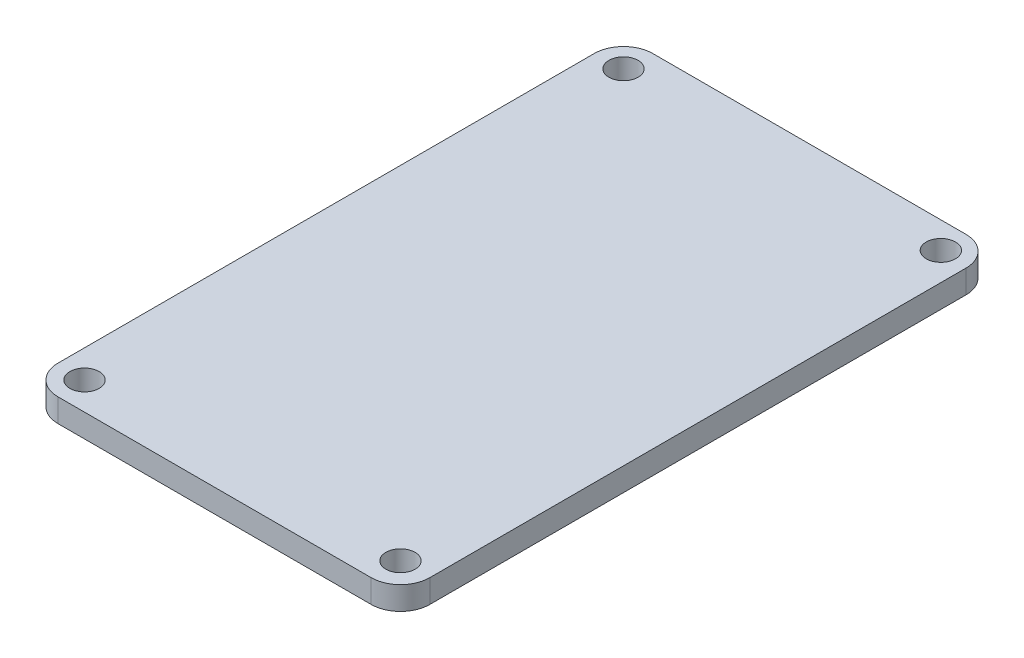
ISO-10303-21;
HEADER;
FILE_DESCRIPTION(('STEP AP214'),'2;1');
FILE_NAME('part.step','',(''),(''),'','','');
FILE_SCHEMA(('AUTOMOTIVE_DESIGN { 1 0 10303 214 1 1 1 1 }'));
ENDSEC;
DATA;
#1=APPLICATION_CONTEXT('core data for automotive mechanical design processes');
#2=APPLICATION_PROTOCOL_DEFINITION('international standard','automotive_design',2000,#1);
#3=PRODUCT_CONTEXT('',#1,'mechanical');
#4=PRODUCT('Part','Part','',(#3));
#5=PRODUCT_RELATED_PRODUCT_CATEGORY('part','',(#4));
#6=PRODUCT_DEFINITION_FORMATION('','',#4);
#7=PRODUCT_DEFINITION_CONTEXT('part definition',#1,'design');
#8=PRODUCT_DEFINITION('design','',#6,#7);
#9=PRODUCT_DEFINITION_SHAPE('','',#8);
#10=(LENGTH_UNIT() NAMED_UNIT(*) SI_UNIT(.MILLI.,.METRE.));
#11=(NAMED_UNIT(*) PLANE_ANGLE_UNIT() SI_UNIT($,.RADIAN.));
#12=(NAMED_UNIT(*) SI_UNIT($,.STERADIAN.) SOLID_ANGLE_UNIT());
#13=UNCERTAINTY_MEASURE_WITH_UNIT(LENGTH_MEASURE(1.E-05),#10,'distance_accuracy_value','');
#14=(GEOMETRIC_REPRESENTATION_CONTEXT(3) GLOBAL_UNCERTAINTY_ASSIGNED_CONTEXT((#13)) GLOBAL_UNIT_ASSIGNED_CONTEXT((#10,
#11,#12)) REPRESENTATION_CONTEXT('',''));
#15=CARTESIAN_POINT('',(0.,0.,0.));
#16=DIRECTION('',(0.,0.,1.));
#17=DIRECTION('',(1.,0.,0.));
#18=AXIS2_PLACEMENT_3D('',#15,#16,#17);
#19=CARTESIAN_POINT('',(-10.7,1.5875,18.32));
#20=DIRECTION('',(0.,-1.,0.));
#21=DIRECTION('',(0.,0.,-1.));
#22=AXIS2_PLACEMENT_3D('',#19,#20,#21);
#23=CYLINDRICAL_SURFACE('',#22,2.);
#24=CARTESIAN_POINT('',(-10.7,0.,18.32));
#25=DIRECTION('',(0.,1.,0.));
#26=DIRECTION('',(0.,0.,1.));
#27=AXIS2_PLACEMENT_3D('',#24,#25,#26);
#28=CIRCLE('',#27,2.);
#29=CARTESIAN_POINT('',(-12.7,0.,18.32));
#30=VERTEX_POINT('',#29);
#31=CARTESIAN_POINT('',(-10.7,0.,20.32));
#32=VERTEX_POINT('',#31);
#33=EDGE_CURVE('E131',#30,#32,#28,.T.);
#34=ORIENTED_EDGE('',*,*,#33,.T.);
#35=DIRECTION('',(0.,-1.,0.));
#36=VECTOR('',#35,1.);
#37=CARTESIAN_POINT('',(-10.7,1.5875,20.32));
#38=LINE('',#37,#36);
#39=CARTESIAN_POINT('',(-10.7,1.5875,20.32));
#40=VERTEX_POINT('',#39);
#41=EDGE_CURVE('E11',#40,#32,#38,.T.);
#42=ORIENTED_EDGE('',*,*,#41,.F.);
#43=CARTESIAN_POINT('',(-10.7,1.5875,18.32));
#44=DIRECTION('',(0.,1.,0.));
#45=DIRECTION('',(0.,0.,1.));
#46=AXIS2_PLACEMENT_3D('',#43,#44,#45);
#47=CIRCLE('',#46,2.);
#48=CARTESIAN_POINT('',(-12.7,1.5875,18.32));
#49=VERTEX_POINT('',#48);
#50=EDGE_CURVE('E146',#49,#40,#47,.T.);
#51=ORIENTED_EDGE('',*,*,#50,.F.);
#52=DIRECTION('',(0.,-1.,0.));
#53=VECTOR('',#52,1.);
#54=CARTESIAN_POINT('',(-12.7,1.5875,18.32));
#55=LINE('',#54,#53);
#56=EDGE_CURVE('E127',#49,#30,#55,.T.);
#57=ORIENTED_EDGE('',*,*,#56,.T.);
#58=EDGE_LOOP('',(#34,#42,#51,#57));
#59=FACE_BOUND('',#58,.T.);
#60=ADVANCED_FACE('F33',(#59),#23,.T.);
#61=CARTESIAN_POINT('',(-10.7,1.5875,20.32));
#62=DIRECTION('',(0.,0.,-1.));
#63=DIRECTION('',(-1.,0.,0.));
#64=AXIS2_PLACEMENT_3D('',#61,#62,#63);
#65=PLANE('',#64);
#66=DIRECTION('',(1.,0.,0.));
#67=VECTOR('',#66,1.);
#68=CARTESIAN_POINT('',(-10.7,0.,20.32));
#69=LINE('',#68,#67);
#70=CARTESIAN_POINT('',(10.7,0.,20.32));
#71=VERTEX_POINT('',#70);
#72=EDGE_CURVE('E134',#32,#71,#69,.T.);
#73=ORIENTED_EDGE('',*,*,#72,.T.);
#74=DIRECTION('',(0.,-1.,0.));
#75=VECTOR('',#74,1.);
#76=CARTESIAN_POINT('',(10.7,1.5875,20.32));
#77=LINE('',#76,#75);
#78=CARTESIAN_POINT('',(10.7,1.5875,20.32));
#79=VERTEX_POINT('',#78);
#80=EDGE_CURVE('E42',#79,#71,#77,.T.);
#81=ORIENTED_EDGE('',*,*,#80,.F.);
#82=DIRECTION('',(1.,0.,0.));
#83=VECTOR('',#82,1.);
#84=CARTESIAN_POINT('',(-10.7,1.5875,20.32));
#85=LINE('',#84,#83);
#86=EDGE_CURVE('E94',#40,#79,#85,.T.);
#87=ORIENTED_EDGE('',*,*,#86,.F.);
#88=ORIENTED_EDGE('',*,*,#41,.T.);
#89=EDGE_LOOP('',(#73,#81,#87,#88));
#90=FACE_BOUND('',#89,.T.);
#91=ADVANCED_FACE('F204',(#90),#65,.F.);
#92=CARTESIAN_POINT('',(10.7,1.5875,18.32));
#93=DIRECTION('',(0.,-1.,0.));
#94=DIRECTION('',(0.,0.,-1.));
#95=AXIS2_PLACEMENT_3D('',#92,#93,#94);
#96=CYLINDRICAL_SURFACE('',#95,2.);
#97=CARTESIAN_POINT('',(10.7,0.,18.32));
#98=DIRECTION('',(0.,1.,0.));
#99=DIRECTION('',(0.,0.,1.));
#100=AXIS2_PLACEMENT_3D('',#97,#98,#99);
#101=CIRCLE('',#100,2.);
#102=CARTESIAN_POINT('',(12.7,0.,18.32));
#103=VERTEX_POINT('',#102);
#104=EDGE_CURVE('E137',#71,#103,#101,.T.);
#105=ORIENTED_EDGE('',*,*,#104,.T.);
#106=DIRECTION('',(0.,-1.,0.));
#107=VECTOR('',#106,1.);
#108=CARTESIAN_POINT('',(12.7,1.5875,18.32));
#109=LINE('',#108,#107);
#110=CARTESIAN_POINT('',(12.7,1.5875,18.32));
#111=VERTEX_POINT('',#110);
#112=EDGE_CURVE('E153',#111,#103,#109,.T.);
#113=ORIENTED_EDGE('',*,*,#112,.F.);
#114=CARTESIAN_POINT('',(10.7,1.5875,18.32));
#115=DIRECTION('',(0.,1.,0.));
#116=DIRECTION('',(0.,0.,1.));
#117=AXIS2_PLACEMENT_3D('',#114,#115,#116);
#118=CIRCLE('',#117,2.);
#119=EDGE_CURVE('E172',#79,#111,#118,.T.);
#120=ORIENTED_EDGE('',*,*,#119,.F.);
#121=ORIENTED_EDGE('',*,*,#80,.T.);
#122=EDGE_LOOP('',(#105,#113,#120,#121));
#123=FACE_BOUND('',#122,.T.);
#124=ADVANCED_FACE('F208',(#123),#96,.T.);
#125=CARTESIAN_POINT('',(12.7,1.5875,18.32));
#126=DIRECTION('',(-1.,0.,0.));
#127=DIRECTION('',(0.,0.,1.));
#128=AXIS2_PLACEMENT_3D('',#125,#126,#127);
#129=PLANE('',#128);
#130=DIRECTION('',(0.,0.,-1.));
#131=VECTOR('',#130,1.);
#132=CARTESIAN_POINT('',(12.7,0.,18.32));
#133=LINE('',#132,#131);
#134=CARTESIAN_POINT('',(12.7,0.,-18.32));
#135=VERTEX_POINT('',#134);
#136=EDGE_CURVE('E139',#103,#135,#133,.T.);
#137=ORIENTED_EDGE('',*,*,#136,.T.);
#138=DIRECTION('',(0.,-1.,0.));
#139=VECTOR('',#138,1.);
#140=CARTESIAN_POINT('',(12.7,1.5875,-18.32));
#141=LINE('',#140,#139);
#142=CARTESIAN_POINT('',(12.7,1.5875,-18.32));
#143=VERTEX_POINT('',#142);
#144=EDGE_CURVE('E150',#143,#135,#141,.T.);
#145=ORIENTED_EDGE('',*,*,#144,.F.);
#146=DIRECTION('',(0.,0.,-1.));
#147=VECTOR('',#146,1.);
#148=CARTESIAN_POINT('',(12.7,1.5875,18.32));
#149=LINE('',#148,#147);
#150=EDGE_CURVE('E174',#111,#143,#149,.T.);
#151=ORIENTED_EDGE('',*,*,#150,.F.);
#152=ORIENTED_EDGE('',*,*,#112,.T.);
#153=EDGE_LOOP('',(#137,#145,#151,#152));
#154=FACE_BOUND('',#153,.T.);
#155=ADVANCED_FACE('F180',(#154),#129,.F.);
#156=CARTESIAN_POINT('',(10.7,1.5875,-18.32));
#157=DIRECTION('',(0.,-1.,0.));
#158=DIRECTION('',(0.,0.,-1.));
#159=AXIS2_PLACEMENT_3D('',#156,#157,#158);
#160=CYLINDRICAL_SURFACE('',#159,2.);
#161=CARTESIAN_POINT('',(10.7,0.,-18.32));
#162=DIRECTION('',(0.,1.,0.));
#163=DIRECTION('',(0.,0.,1.));
#164=AXIS2_PLACEMENT_3D('',#161,#162,#163);
#165=CIRCLE('',#164,2.);
#166=CARTESIAN_POINT('',(10.7,0.,-20.32));
#167=VERTEX_POINT('',#166);
#168=EDGE_CURVE('E141',#135,#167,#165,.T.);
#169=ORIENTED_EDGE('',*,*,#168,.T.);
#170=DIRECTION('',(0.,-1.,0.));
#171=VECTOR('',#170,1.);
#172=CARTESIAN_POINT('',(10.7,1.5875,-20.32));
#173=LINE('',#172,#171);
#174=CARTESIAN_POINT('',(10.7,1.5875,-20.32));
#175=VERTEX_POINT('',#174);
#176=EDGE_CURVE('E122',#175,#167,#173,.T.);
#177=ORIENTED_EDGE('',*,*,#176,.F.);
#178=CARTESIAN_POINT('',(10.7,1.5875,-18.32));
#179=DIRECTION('',(0.,1.,0.));
#180=DIRECTION('',(0.,0.,1.));
#181=AXIS2_PLACEMENT_3D('',#178,#179,#180);
#182=CIRCLE('',#181,2.);
#183=EDGE_CURVE('E113',#143,#175,#182,.T.);
#184=ORIENTED_EDGE('',*,*,#183,.F.);
#185=ORIENTED_EDGE('',*,*,#144,.T.);
#186=EDGE_LOOP('',(#169,#177,#184,#185));
#187=FACE_BOUND('',#186,.T.);
#188=ADVANCED_FACE('F184',(#187),#160,.T.);
#189=CARTESIAN_POINT('',(-10.7,1.5875,-20.32));
#190=DIRECTION('',(0.,0.,1.));
#191=DIRECTION('',(1.,0.,0.));
#192=AXIS2_PLACEMENT_3D('',#189,#190,#191);
#193=PLANE('',#192);
#194=DIRECTION('',(-1.,0.,0.));
#195=VECTOR('',#194,1.);
#196=CARTESIAN_POINT('',(-10.7,0.,-20.32));
#197=LINE('',#196,#195);
#198=CARTESIAN_POINT('',(-10.7,0.,-20.32));
#199=VERTEX_POINT('',#198);
#200=EDGE_CURVE('E121',#167,#199,#197,.T.);
#201=ORIENTED_EDGE('',*,*,#200,.T.);
#202=DIRECTION('',(0.,-1.,0.));
#203=VECTOR('',#202,1.);
#204=CARTESIAN_POINT('',(-10.7,1.5875,-20.32));
#205=LINE('',#204,#203);
#206=CARTESIAN_POINT('',(-10.7,1.5875,-20.32));
#207=VERTEX_POINT('',#206);
#208=EDGE_CURVE('E118',#207,#199,#205,.T.);
#209=ORIENTED_EDGE('',*,*,#208,.F.);
#210=DIRECTION('',(-1.,0.,0.));
#211=VECTOR('',#210,1.);
#212=CARTESIAN_POINT('',(-10.7,1.5875,-20.32));
#213=LINE('',#212,#211);
#214=EDGE_CURVE('E107',#175,#207,#213,.T.);
#215=ORIENTED_EDGE('',*,*,#214,.F.);
#216=ORIENTED_EDGE('',*,*,#176,.T.);
#217=EDGE_LOOP('',(#201,#209,#215,#216));
#218=FACE_BOUND('',#217,.T.);
#219=ADVANCED_FACE('F119',(#218),#193,.F.);
#220=CARTESIAN_POINT('',(-10.7,1.5875,-18.32));
#221=DIRECTION('',(0.,-1.,0.));
#222=DIRECTION('',(0.,0.,-1.));
#223=AXIS2_PLACEMENT_3D('',#220,#221,#222);
#224=CYLINDRICAL_SURFACE('',#223,2.);
#225=CARTESIAN_POINT('',(-10.7,0.,-18.32));
#226=DIRECTION('',(0.,1.,0.));
#227=DIRECTION('',(0.,0.,1.));
#228=AXIS2_PLACEMENT_3D('',#225,#226,#227);
#229=CIRCLE('',#228,2.);
#230=CARTESIAN_POINT('',(-12.7,0.,-18.32));
#231=VERTEX_POINT('',#230);
#232=EDGE_CURVE('E80',#199,#231,#229,.T.);
#233=ORIENTED_EDGE('',*,*,#232,.T.);
#234=DIRECTION('',(0.,-1.,0.));
#235=VECTOR('',#234,1.);
#236=CARTESIAN_POINT('',(-12.7,1.5875,-18.32));
#237=LINE('',#236,#235);
#238=CARTESIAN_POINT('',(-12.7,1.5875,-18.32));
#239=VERTEX_POINT('',#238);
#240=EDGE_CURVE('E123',#239,#231,#237,.T.);
#241=ORIENTED_EDGE('',*,*,#240,.F.);
#242=CARTESIAN_POINT('',(-10.7,1.5875,-18.32));
#243=DIRECTION('',(0.,1.,0.));
#244=DIRECTION('',(0.,0.,1.));
#245=AXIS2_PLACEMENT_3D('',#242,#243,#244);
#246=CIRCLE('',#245,2.);
#247=EDGE_CURVE('E111',#207,#239,#246,.T.);
#248=ORIENTED_EDGE('',*,*,#247,.F.);
#249=ORIENTED_EDGE('',*,*,#208,.T.);
#250=EDGE_LOOP('',(#233,#241,#248,#249));
#251=FACE_BOUND('',#250,.T.);
#252=ADVANCED_FACE('F125',(#251),#224,.T.);
#253=CARTESIAN_POINT('',(-12.7,1.5875,18.32));
#254=DIRECTION('',(1.,0.,0.));
#255=DIRECTION('',(0.,0.,-1.));
#256=AXIS2_PLACEMENT_3D('',#253,#254,#255);
#257=PLANE('',#256);
#258=DIRECTION('',(0.,0.,1.));
#259=VECTOR('',#258,1.);
#260=CARTESIAN_POINT('',(-12.7,0.,18.32));
#261=LINE('',#260,#259);
#262=EDGE_CURVE('E86',#231,#30,#261,.T.);
#263=ORIENTED_EDGE('',*,*,#262,.T.);
#264=ORIENTED_EDGE('',*,*,#56,.F.);
#265=DIRECTION('',(0.,0.,1.));
#266=VECTOR('',#265,1.);
#267=CARTESIAN_POINT('',(-12.7,1.5875,18.32));
#268=LINE('',#267,#266);
#269=EDGE_CURVE('E51',#239,#49,#268,.T.);
#270=ORIENTED_EDGE('',*,*,#269,.F.);
#271=ORIENTED_EDGE('',*,*,#240,.T.);
#272=EDGE_LOOP('',(#263,#264,#270,#271));
#273=FACE_BOUND('',#272,.T.);
#274=ADVANCED_FACE('F192',(#273),#257,.F.);
#275=CARTESIAN_POINT('',(-10.7,1.5875,18.32));
#276=DIRECTION('',(0.,1.,0.));
#277=DIRECTION('',(0.,0.,1.));
#278=AXIS2_PLACEMENT_3D('',#275,#276,#277);
#279=PLANE('',#278);
#280=CARTESIAN_POINT('',(-10.7947909901879,1.5875,-18.415));
#281=DIRECTION('',(0.,1.,0.));
#282=DIRECTION('',(0.,0.,1.));
#283=AXIS2_PLACEMENT_3D('',#280,#281,#282);
#284=CIRCLE('',#283,0.999999999999996);
#285=CARTESIAN_POINT('',(-10.7947909901879,1.5875,-17.415));
#286=VERTEX_POINT('',#285);
#287=EDGE_CURVE('E292',#286,#286,#284,.T.);
#288=ORIENTED_EDGE('',*,*,#287,.F.);
#289=EDGE_LOOP('',(#288));
#290=FACE_BOUND('',#289,.T.);
#291=CARTESIAN_POINT('',(10.795,1.5875,-18.51));
#292=DIRECTION('',(0.,1.,0.));
#293=DIRECTION('',(0.,0.,1.));
#294=AXIS2_PLACEMENT_3D('',#291,#292,#293);
#295=CIRCLE('',#294,0.999999999999996);
#296=CARTESIAN_POINT('',(10.795,1.5875,-17.51));
#297=VERTEX_POINT('',#296);
#298=EDGE_CURVE('E296',#297,#297,#295,.T.);
#299=ORIENTED_EDGE('',*,*,#298,.F.);
#300=EDGE_LOOP('',(#299));
#301=FACE_BOUND('',#300,.T.);
#302=CARTESIAN_POINT('',(10.7,1.5875,18.32));
#303=DIRECTION('',(0.,1.,0.));
#304=DIRECTION('',(0.,0.,1.));
#305=AXIS2_PLACEMENT_3D('',#302,#303,#304);
#306=CIRCLE('',#305,0.999999999999996);
#307=CARTESIAN_POINT('',(10.7,1.5875,19.32));
#308=VERTEX_POINT('',#307);
#309=EDGE_CURVE('E166',#308,#308,#306,.T.);
#310=ORIENTED_EDGE('',*,*,#309,.F.);
#311=EDGE_LOOP('',(#310));
#312=FACE_BOUND('',#311,.T.);
#313=CARTESIAN_POINT('',(-10.7947909901879,1.5875,18.415));
#314=DIRECTION('',(0.,1.,0.));
#315=DIRECTION('',(0.,0.,1.));
#316=AXIS2_PLACEMENT_3D('',#313,#314,#315);
#317=CIRCLE('',#316,0.999999999999996);
#318=CARTESIAN_POINT('',(-10.7947909901879,1.5875,19.415));
#319=VERTEX_POINT('',#318);
#320=EDGE_CURVE('E158',#319,#319,#317,.T.);
#321=ORIENTED_EDGE('',*,*,#320,.F.);
#322=EDGE_LOOP('',(#321));
#323=FACE_BOUND('',#322,.T.);
#324=ORIENTED_EDGE('',*,*,#50,.T.);
#325=ORIENTED_EDGE('',*,*,#86,.T.);
#326=ORIENTED_EDGE('',*,*,#119,.T.);
#327=ORIENTED_EDGE('',*,*,#150,.T.);
#328=ORIENTED_EDGE('',*,*,#183,.T.);
#329=ORIENTED_EDGE('',*,*,#214,.T.);
#330=ORIENTED_EDGE('',*,*,#247,.T.);
#331=ORIENTED_EDGE('',*,*,#269,.T.);
#332=EDGE_LOOP('',(#324,#325,#326,#327,#328,#329,#330,#331));
#333=FACE_BOUND('',#332,.T.);
#334=ADVANCED_FACE('F109',(#290,#301,#312,#323,#333),#279,.T.);
#335=CARTESIAN_POINT('',(-10.7,0.,18.32));
#336=DIRECTION('',(0.,1.,0.));
#337=DIRECTION('',(0.,0.,1.));
#338=AXIS2_PLACEMENT_3D('',#335,#336,#337);
#339=PLANE('',#338);
#340=CARTESIAN_POINT('',(-10.7947909901879,0.,-18.415));
#341=DIRECTION('',(0.,1.,0.));
#342=DIRECTION('',(0.,0.,1.));
#343=AXIS2_PLACEMENT_3D('',#340,#341,#342);
#344=CIRCLE('',#343,0.999999999999993);
#345=CARTESIAN_POINT('',(-10.7947909901879,0.,-17.415));
#346=VERTEX_POINT('',#345);
#347=EDGE_CURVE('E295',#346,#346,#344,.T.);
#348=ORIENTED_EDGE('',*,*,#347,.T.);
#349=EDGE_LOOP('',(#348));
#350=FACE_BOUND('',#349,.T.);
#351=CARTESIAN_POINT('',(10.795,0.,-18.51));
#352=DIRECTION('',(0.,1.,0.));
#353=DIRECTION('',(0.,0.,1.));
#354=AXIS2_PLACEMENT_3D('',#351,#352,#353);
#355=CIRCLE('',#354,0.999999999999993);
#356=CARTESIAN_POINT('',(10.795,0.,-17.51));
#357=VERTEX_POINT('',#356);
#358=EDGE_CURVE('E299',#357,#357,#355,.T.);
#359=ORIENTED_EDGE('',*,*,#358,.T.);
#360=EDGE_LOOP('',(#359));
#361=FACE_BOUND('',#360,.T.);
#362=CARTESIAN_POINT('',(10.7,0.,18.32));
#363=DIRECTION('',(0.,1.,0.));
#364=DIRECTION('',(0.,0.,1.));
#365=AXIS2_PLACEMENT_3D('',#362,#363,#364);
#366=CIRCLE('',#365,0.999999999999993);
#367=CARTESIAN_POINT('',(10.7,0.,19.32));
#368=VERTEX_POINT('',#367);
#369=EDGE_CURVE('E36',#368,#368,#366,.T.);
#370=ORIENTED_EDGE('',*,*,#369,.T.);
#371=EDGE_LOOP('',(#370));
#372=FACE_BOUND('',#371,.T.);
#373=CARTESIAN_POINT('',(-10.7947909901879,0.,18.415));
#374=DIRECTION('',(0.,1.,0.));
#375=DIRECTION('',(0.,0.,1.));
#376=AXIS2_PLACEMENT_3D('',#373,#374,#375);
#377=CIRCLE('',#376,0.999999999999993);
#378=CARTESIAN_POINT('',(-10.7947909901879,0.,19.415));
#379=VERTEX_POINT('',#378);
#380=EDGE_CURVE('E135',#379,#379,#377,.T.);
#381=ORIENTED_EDGE('',*,*,#380,.T.);
#382=EDGE_LOOP('',(#381));
#383=FACE_BOUND('',#382,.T.);
#384=ORIENTED_EDGE('',*,*,#33,.F.);
#385=ORIENTED_EDGE('',*,*,#262,.F.);
#386=ORIENTED_EDGE('',*,*,#232,.F.);
#387=ORIENTED_EDGE('',*,*,#200,.F.);
#388=ORIENTED_EDGE('',*,*,#168,.F.);
#389=ORIENTED_EDGE('',*,*,#136,.F.);
#390=ORIENTED_EDGE('',*,*,#104,.F.);
#391=ORIENTED_EDGE('',*,*,#72,.F.);
#392=EDGE_LOOP('',(#384,#385,#386,#387,#388,#389,#390,#391));
#393=FACE_BOUND('',#392,.T.);
#394=ADVANCED_FACE('F187',(#350,#361,#372,#383,#393),#339,.F.);
#395=CARTESIAN_POINT('',(-10.7947909901879,1.5875,18.415));
#396=DIRECTION('',(0.,1.,0.));
#397=DIRECTION('',(0.,0.,1.));
#398=AXIS2_PLACEMENT_3D('',#395,#396,#397);
#399=CYLINDRICAL_SURFACE('',#398,0.999999999999993);
#400=ORIENTED_EDGE('',*,*,#320,.T.);
#401=EDGE_LOOP('',(#400));
#402=FACE_BOUND('',#401,.T.);
#403=ORIENTED_EDGE('',*,*,#380,.F.);
#404=EDGE_LOOP('',(#403));
#405=FACE_BOUND('',#404,.T.);
#406=ADVANCED_FACE('F247',(#402,#405),#399,.F.);
#407=CARTESIAN_POINT('',(10.7,1.5875,18.32));
#408=DIRECTION('',(0.,1.,0.));
#409=DIRECTION('',(0.,0.,1.));
#410=AXIS2_PLACEMENT_3D('',#407,#408,#409);
#411=CYLINDRICAL_SURFACE('',#410,0.999999999999993);
#412=ORIENTED_EDGE('',*,*,#309,.T.);
#413=EDGE_LOOP('',(#412));
#414=FACE_BOUND('',#413,.T.);
#415=ORIENTED_EDGE('',*,*,#369,.F.);
#416=EDGE_LOOP('',(#415));
#417=FACE_BOUND('',#416,.T.);
#418=ADVANCED_FACE('F256',(#414,#417),#411,.F.);
#419=CARTESIAN_POINT('',(10.795,1.5875,-18.51));
#420=DIRECTION('',(0.,1.,0.));
#421=DIRECTION('',(0.,0.,1.));
#422=AXIS2_PLACEMENT_3D('',#419,#420,#421);
#423=CYLINDRICAL_SURFACE('',#422,0.999999999999993);
#424=ORIENTED_EDGE('',*,*,#298,.T.);
#425=EDGE_LOOP('',(#424));
#426=FACE_BOUND('',#425,.T.);
#427=ORIENTED_EDGE('',*,*,#358,.F.);
#428=EDGE_LOOP('',(#427));
#429=FACE_BOUND('',#428,.T.);
#430=ADVANCED_FACE('F265',(#426,#429),#423,.F.);
#431=CARTESIAN_POINT('',(-10.7947909901879,1.5875,-18.415));
#432=DIRECTION('',(0.,1.,0.));
#433=DIRECTION('',(0.,0.,1.));
#434=AXIS2_PLACEMENT_3D('',#431,#432,#433);
#435=CYLINDRICAL_SURFACE('',#434,0.999999999999993);
#436=ORIENTED_EDGE('',*,*,#287,.T.);
#437=EDGE_LOOP('',(#436));
#438=FACE_BOUND('',#437,.T.);
#439=ORIENTED_EDGE('',*,*,#347,.F.);
#440=EDGE_LOOP('',(#439));
#441=FACE_BOUND('',#440,.T.);
#442=ADVANCED_FACE('F275',(#438,#441),#435,.F.);
#443=CLOSED_SHELL('',(#60,#91,#124,#155,#188,#219,#252,#274,#334,#394,#406,#418,#430,#442));
#444=MANIFOLD_SOLID_BREP('B2',#443);
#445=ADVANCED_BREP_SHAPE_REPRESENTATION('',(#18,#444),#14);
#446=SHAPE_DEFINITION_REPRESENTATION(#9,#445);
ENDSEC;
END-ISO-10303-21;
